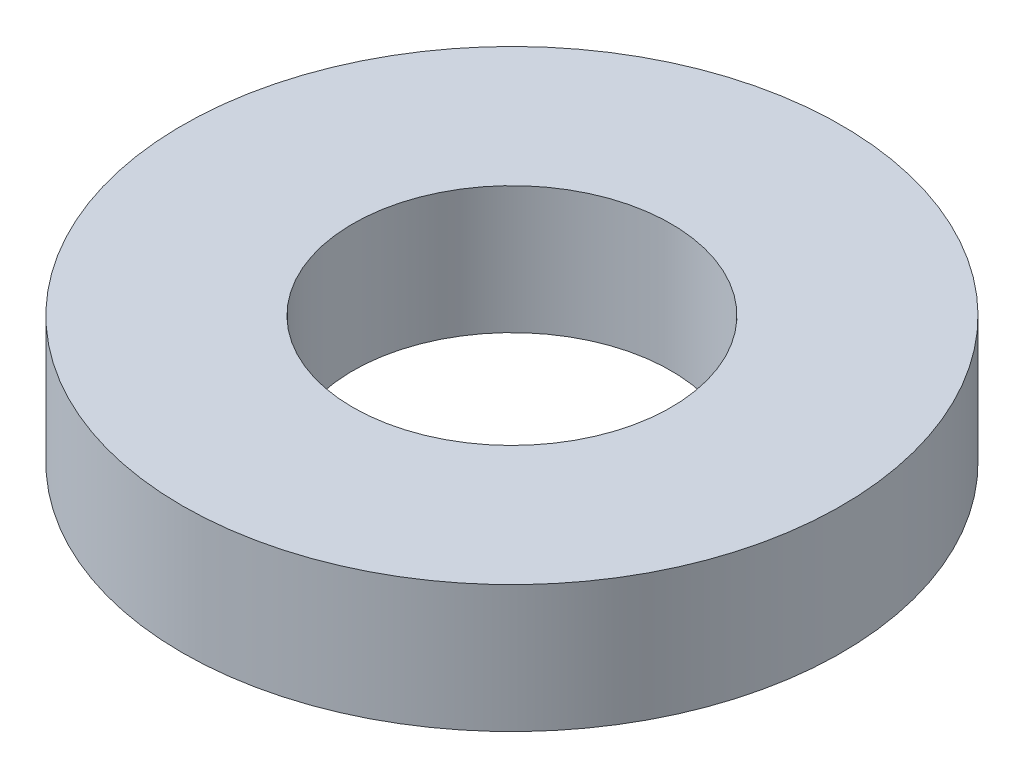
ISO-10303-21;
HEADER;
FILE_DESCRIPTION(('STEP AP214'),'2;1');
FILE_NAME('part.step','',(''),(''),'','','');
FILE_SCHEMA(('AUTOMOTIVE_DESIGN { 1 0 10303 214 1 1 1 1 }'));
ENDSEC;
DATA;
#1=APPLICATION_CONTEXT('core data for automotive mechanical design processes');
#2=APPLICATION_PROTOCOL_DEFINITION('international standard','automotive_design',2000,#1);
#3=PRODUCT_CONTEXT('',#1,'mechanical');
#4=PRODUCT('Part','Part','',(#3));
#5=PRODUCT_RELATED_PRODUCT_CATEGORY('part','',(#4));
#6=PRODUCT_DEFINITION_FORMATION('','',#4);
#7=PRODUCT_DEFINITION_CONTEXT('part definition',#1,'design');
#8=PRODUCT_DEFINITION('design','',#6,#7);
#9=PRODUCT_DEFINITION_SHAPE('','',#8);
#10=(LENGTH_UNIT() NAMED_UNIT(*) SI_UNIT(.MILLI.,.METRE.));
#11=(NAMED_UNIT(*) PLANE_ANGLE_UNIT() SI_UNIT($,.RADIAN.));
#12=(NAMED_UNIT(*) SI_UNIT($,.STERADIAN.) SOLID_ANGLE_UNIT());
#13=UNCERTAINTY_MEASURE_WITH_UNIT(LENGTH_MEASURE(1.E-05),#10,'distance_accuracy_value','');
#14=(GEOMETRIC_REPRESENTATION_CONTEXT(3) GLOBAL_UNCERTAINTY_ASSIGNED_CONTEXT((#13)) GLOBAL_UNIT_ASSIGNED_CONTEXT((#10,
#11,#12)) REPRESENTATION_CONTEXT('',''));
#15=CARTESIAN_POINT('',(0.,0.,0.));
#16=DIRECTION('',(0.,0.,1.));
#17=DIRECTION('',(1.,0.,0.));
#18=AXIS2_PLACEMENT_3D('',#15,#16,#17);
#19=CARTESIAN_POINT('',(0.,28.,0.));
#20=DIRECTION('',(0.,-1.,0.));
#21=DIRECTION('',(0.,0.,-1.));
#22=AXIS2_PLACEMENT_3D('',#19,#20,#21);
#23=CYLINDRICAL_SURFACE('',#22,72.5);
#24=CARTESIAN_POINT('',(0.,28.,0.));
#25=DIRECTION('',(0.,1.,0.));
#26=DIRECTION('',(0.,0.,1.));
#27=AXIS2_PLACEMENT_3D('',#24,#25,#26);
#28=CIRCLE('',#27,72.5);
#29=CARTESIAN_POINT('',(0.,28.,72.5));
#30=VERTEX_POINT('',#29);
#31=EDGE_CURVE('E10',#30,#30,#28,.T.);
#32=ORIENTED_EDGE('',*,*,#31,.F.);
#33=EDGE_LOOP('',(#32));
#34=FACE_BOUND('',#33,.T.);
#35=CARTESIAN_POINT('',(0.,0.,0.));
#36=DIRECTION('',(0.,1.,0.));
#37=DIRECTION('',(0.,0.,1.));
#38=AXIS2_PLACEMENT_3D('',#35,#36,#37);
#39=CIRCLE('',#38,72.5);
#40=CARTESIAN_POINT('',(0.,0.,72.5));
#41=VERTEX_POINT('',#40);
#42=EDGE_CURVE('E37',#41,#41,#39,.T.);
#43=ORIENTED_EDGE('',*,*,#42,.T.);
#44=EDGE_LOOP('',(#43));
#45=FACE_BOUND('',#44,.T.);
#46=ADVANCED_FACE('F40',(#34,#45),#23,.T.);
#47=CARTESIAN_POINT('',(0.,28.,0.));
#48=DIRECTION('',(0.,1.,0.));
#49=DIRECTION('',(0.,0.,1.));
#50=AXIS2_PLACEMENT_3D('',#47,#48,#49);
#51=PLANE('',#50);
#52=CARTESIAN_POINT('',(0.,28.,0.));
#53=DIRECTION('',(0.,1.,0.));
#54=DIRECTION('',(0.,0.,1.));
#55=AXIS2_PLACEMENT_3D('',#52,#53,#54);
#56=CIRCLE('',#55,35.);
#57=CARTESIAN_POINT('',(0.,28.,35.));
#58=VERTEX_POINT('',#57);
#59=EDGE_CURVE('E50',#58,#58,#56,.T.);
#60=ORIENTED_EDGE('',*,*,#59,.F.);
#61=EDGE_LOOP('',(#60));
#62=FACE_BOUND('',#61,.T.);
#63=ORIENTED_EDGE('',*,*,#31,.T.);
#64=EDGE_LOOP('',(#63));
#65=FACE_BOUND('',#64,.T.);
#66=ADVANCED_FACE('F59',(#62,#65),#51,.T.);
#67=CARTESIAN_POINT('',(0.,0.,0.));
#68=DIRECTION('',(0.,1.,0.));
#69=DIRECTION('',(0.,0.,1.));
#70=AXIS2_PLACEMENT_3D('',#67,#68,#69);
#71=PLANE('',#70);
#72=CARTESIAN_POINT('',(0.,0.,0.));
#73=DIRECTION('',(0.,1.,0.));
#74=DIRECTION('',(0.,0.,1.));
#75=AXIS2_PLACEMENT_3D('',#72,#73,#74);
#76=CIRCLE('',#75,35.);
#77=CARTESIAN_POINT('',(0.,0.,35.));
#78=VERTEX_POINT('',#77);
#79=EDGE_CURVE('E47',#78,#78,#76,.T.);
#80=ORIENTED_EDGE('',*,*,#79,.T.);
#81=EDGE_LOOP('',(#80));
#82=FACE_BOUND('',#81,.T.);
#83=ORIENTED_EDGE('',*,*,#42,.F.);
#84=EDGE_LOOP('',(#83));
#85=FACE_BOUND('',#84,.T.);
#86=ADVANCED_FACE('F58',(#82,#85),#71,.F.);
#87=CARTESIAN_POINT('',(0.,28.,0.));
#88=DIRECTION('',(0.,-1.,0.));
#89=DIRECTION('',(0.,0.,-1.));
#90=AXIS2_PLACEMENT_3D('',#87,#88,#89);
#91=CYLINDRICAL_SURFACE('',#90,35.);
#92=ORIENTED_EDGE('',*,*,#59,.T.);
#93=EDGE_LOOP('',(#92));
#94=FACE_BOUND('',#93,.T.);
#95=ORIENTED_EDGE('',*,*,#79,.F.);
#96=EDGE_LOOP('',(#95));
#97=FACE_BOUND('',#96,.T.);
#98=ADVANCED_FACE('F54',(#94,#97),#91,.F.);
#99=CLOSED_SHELL('',(#46,#66,#86,#98));
#100=MANIFOLD_SOLID_BREP('B2',#99);
#101=ADVANCED_BREP_SHAPE_REPRESENTATION('',(#18,#100),#14);
#102=SHAPE_DEFINITION_REPRESENTATION(#9,#101);
ENDSEC;
END-ISO-10303-21;
